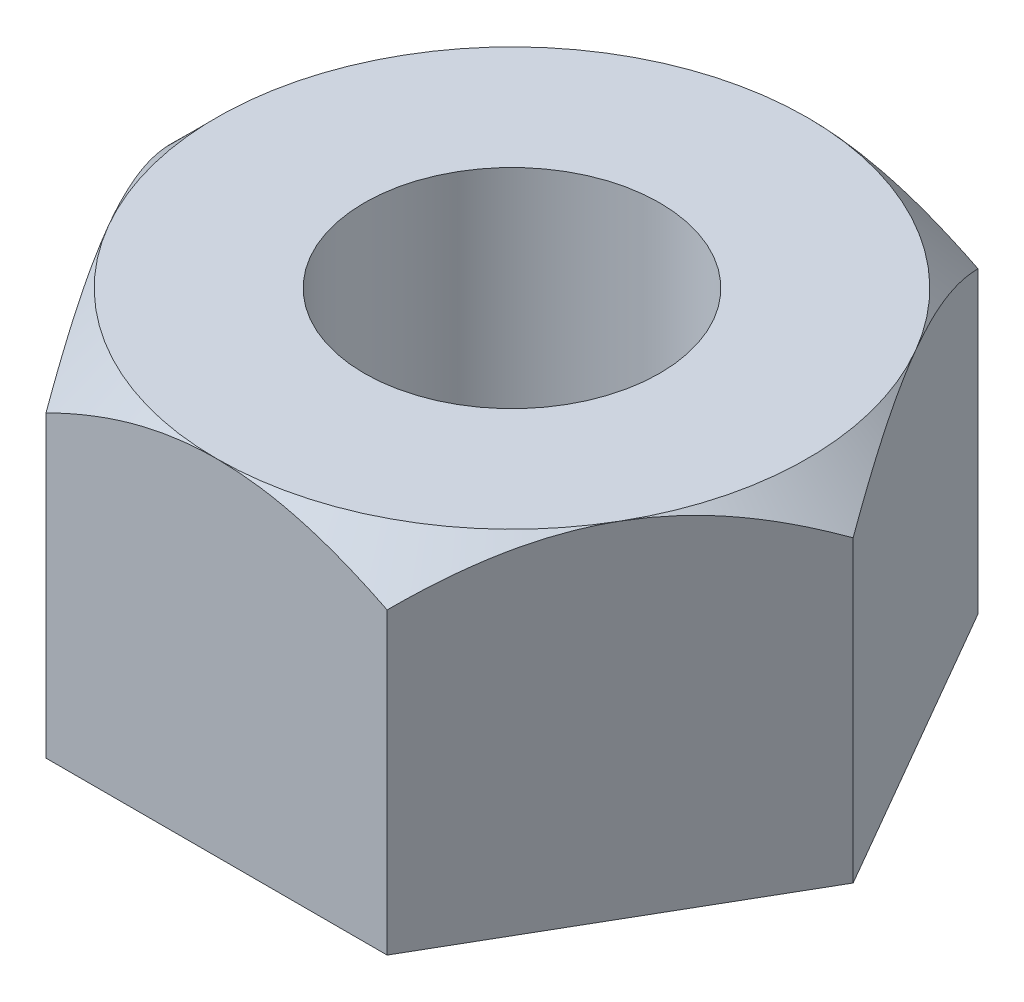
ISO-10303-21;
HEADER;
FILE_DESCRIPTION(('STEP AP214'),'2;1');
FILE_NAME('part.step','',(''),(''),'','','');
FILE_SCHEMA(('AUTOMOTIVE_DESIGN { 1 0 10303 214 1 1 1 1 }'));
ENDSEC;
DATA;
#1=APPLICATION_CONTEXT('core data for automotive mechanical design processes');
#2=APPLICATION_PROTOCOL_DEFINITION('international standard','automotive_design',2000,#1);
#3=PRODUCT_CONTEXT('',#1,'mechanical');
#4=PRODUCT('Part','Part','',(#3));
#5=PRODUCT_RELATED_PRODUCT_CATEGORY('part','',(#4));
#6=PRODUCT_DEFINITION_FORMATION('','',#4);
#7=PRODUCT_DEFINITION_CONTEXT('part definition',#1,'design');
#8=PRODUCT_DEFINITION('design','',#6,#7);
#9=PRODUCT_DEFINITION_SHAPE('','',#8);
#10=(LENGTH_UNIT() NAMED_UNIT(*) SI_UNIT(.MILLI.,.METRE.));
#11=(NAMED_UNIT(*) PLANE_ANGLE_UNIT() SI_UNIT($,.RADIAN.));
#12=(NAMED_UNIT(*) SI_UNIT($,.STERADIAN.) SOLID_ANGLE_UNIT());
#13=UNCERTAINTY_MEASURE_WITH_UNIT(LENGTH_MEASURE(1.E-05),#10,'distance_accuracy_value','');
#14=(GEOMETRIC_REPRESENTATION_CONTEXT(3) GLOBAL_UNCERTAINTY_ASSIGNED_CONTEXT((#13)) GLOBAL_UNIT_ASSIGNED_CONTEXT((#10,
#11,#12)) REPRESENTATION_CONTEXT('',''));
#15=CARTESIAN_POINT('',(0.,0.,0.));
#16=DIRECTION('',(0.,0.,1.));
#17=DIRECTION('',(1.,0.,0.));
#18=AXIS2_PLACEMENT_3D('',#15,#16,#17);
#19=CARTESIAN_POINT('',(0.,35.,0.));
#20=DIRECTION('',(0.,1.,0.));
#21=DIRECTION('',(0.,0.,1.));
#22=AXIS2_PLACEMENT_3D('',#19,#20,#21);
#23=PLANE('',#22);
#24=CARTESIAN_POINT('',(0.,35.,0.));
#25=DIRECTION('',(0.,1.,0.));
#26=DIRECTION('',(0.,0.,1.));
#27=AXIS2_PLACEMENT_3D('',#24,#25,#26);
#28=CIRCLE('',#27,15.);
#29=CARTESIAN_POINT('',(0.,35.,15.));
#30=VERTEX_POINT('',#29);
#31=EDGE_CURVE('E268',#30,#30,#28,.T.);
#32=ORIENTED_EDGE('',*,*,#31,.F.);
#33=EDGE_LOOP('',(#32));
#34=FACE_BOUND('',#33,.T.);
#35=CARTESIAN_POINT('',(0.,35.,0.));
#36=DIRECTION('',(0.,1.,0.));
#37=DIRECTION('',(0.,0.,1.));
#38=AXIS2_PLACEMENT_3D('',#35,#36,#37);
#39=CIRCLE('',#38,30.);
#40=CARTESIAN_POINT('',(-25.980762113533,35.,15.0000000000002));
#41=VERTEX_POINT('',#40);
#42=CARTESIAN_POINT('',(3.12250225675825E-13,35.,30.));
#43=VERTEX_POINT('',#42);
#44=EDGE_CURVE('E142',#41,#43,#39,.T.);
#45=ORIENTED_EDGE('',*,*,#44,.T.);
#46=CARTESIAN_POINT('',(25.9807621135333,35.,14.9999999999999));
#47=VERTEX_POINT('',#46);
#48=EDGE_CURVE('E126',#43,#47,#39,.T.);
#49=ORIENTED_EDGE('',*,*,#48,.T.);
#50=CARTESIAN_POINT('',(25.9807621135331,35.,-15.));
#51=VERTEX_POINT('',#50);
#52=EDGE_CURVE('E116',#47,#51,#39,.T.);
#53=ORIENTED_EDGE('',*,*,#52,.T.);
#54=CARTESIAN_POINT('',(0.,35.,-30.));
#55=VERTEX_POINT('',#54);
#56=EDGE_CURVE('E60',#51,#55,#39,.T.);
#57=ORIENTED_EDGE('',*,*,#56,.T.);
#58=CARTESIAN_POINT('',(-25.9807621135333,35.,-14.9999999999998));
#59=VERTEX_POINT('',#58);
#60=EDGE_CURVE('E68',#55,#59,#39,.T.);
#61=ORIENTED_EDGE('',*,*,#60,.T.);
#62=EDGE_CURVE('E146',#59,#41,#39,.T.);
#63=ORIENTED_EDGE('',*,*,#62,.T.);
#64=EDGE_LOOP('',(#45,#49,#53,#57,#61,#63));
#65=FACE_BOUND('',#64,.T.);
#66=ADVANCED_FACE('F38',(#34,#65),#23,.T.);
#67=CARTESIAN_POINT('',(17.3205080756891,35.,29.9999999999998));
#68=DIRECTION('',(-0.866025403784441,0.,-0.499999999999995));
#69=DIRECTION('',(-0.499999999999995,0.,0.866025403784441));
#70=AXIS2_PLACEMENT_3D('',#67,#68,#69);
#71=PLANE('',#70);
#72=CARTESIAN_POINT('',(17.3203926056353,30.3588683779913,30.0001999999998));
#73=CARTESIAN_POINT('',(17.6181648996009,30.6565922675911,29.484443257765));
#74=CARTESIAN_POINT('',(17.9182692240219,30.9452310098539,28.9646473202967));
#75=CARTESIAN_POINT('',(18.5235048397212,31.5014524216355,27.9163484833553));
#76=CARTESIAN_POINT('',(18.828638767824,31.7690235922971,27.3878410167682));
#77=CARTESIAN_POINT('',(19.4457355870908,32.28135715527,26.3189979726089));
#78=CARTESIAN_POINT('',(19.7577275741082,32.5259801897935,25.7786119995404));
#79=CARTESIAN_POINT('',(20.3868359587446,32.9871045468611,24.6889643138826));
#80=CARTESIAN_POINT('',(20.7039515645858,33.2036101686621,24.1397039726926));
#81=CARTESIAN_POINT('',(21.338183053422,33.6016347745125,23.0411828102682));
#82=CARTESIAN_POINT('',(21.6552206327595,33.7836500599617,22.4920576149471));
#83=CARTESIAN_POINT('',(22.2937926281989,34.1131992314035,21.3860184745553));
#84=CARTESIAN_POINT('',(22.615327264317,34.2607314240311,20.8291041484056));
#85=CARTESIAN_POINT('',(23.2614301523142,34.5175604489245,19.7100211194775));
#86=CARTESIAN_POINT('',(23.5859895047951,34.6269462759727,19.1478678309089));
#87=CARTESIAN_POINT('',(24.2378736643975,34.8050674934494,18.0187713458282));
#88=CARTESIAN_POINT('',(24.5651980509052,34.8738089576004,17.4518288778406));
#89=CARTESIAN_POINT('',(25.1280480592741,34.9552186228279,16.476944066305));
#90=CARTESIAN_POINT('',(25.3632091799513,34.9782734749676,16.0696330573272));
#91=CARTESIAN_POINT('',(25.8338106335002,35.0022474537773,15.2545274296647));
#92=CARTESIAN_POINT('',(26.0692509528371,35.0031676128692,14.8467328344231));
#93=CARTESIAN_POINT('',(26.5399741023156,34.9828501379884,14.0314164232274));
#94=CARTESIAN_POINT('',(26.7752568456213,34.9616045524011,13.6238947576778));
#95=CARTESIAN_POINT('',(27.2450758342509,34.8972716720897,12.8101443990106));
#96=CARTESIAN_POINT('',(27.4796120667069,34.8541840028935,12.403915728181));
#97=CARTESIAN_POINT('',(27.947702065918,34.7467531036108,11.5931600670326));
#98=CARTESIAN_POINT('',(28.1812545835327,34.6823881940278,11.1886352402883));
#99=CARTESIAN_POINT('',(28.6467513766859,34.5333163191623,10.3823711437865));
#100=CARTESIAN_POINT('',(28.878695465253,34.448607028423,9.98063219787308));
#101=CARTESIAN_POINT('',(29.3405639733419,34.2599824813795,9.18065247544698));
#102=CARTESIAN_POINT('',(29.5704888250559,34.1560714453666,8.78241095035556));
#103=CARTESIAN_POINT('',(30.0281274167467,33.9302733745607,7.98975765804288));
#104=CARTESIAN_POINT('',(30.2558409765441,33.8083848878218,7.59534620290149));
#105=CARTESIAN_POINT('',(30.8420828137656,33.4713620227356,6.5799455553113));
#106=CARTESIAN_POINT('',(31.1987982858363,33.2435417347324,5.96209623383893));
#107=CARTESIAN_POINT('',(31.905785122213,32.7512157331125,4.73755911295196));
#108=CARTESIAN_POINT('',(32.2560562916387,32.4867089121269,4.13087165108014));
#109=CARTESIAN_POINT('',(32.9491182127463,31.9268817702841,2.93045319093047));
#110=CARTESIAN_POINT('',(33.2919285978236,31.6316583559979,2.33668818661439));
#111=CARTESIAN_POINT('',(33.8014058168872,31.1686767682003,1.45424775789719));
#112=CARTESIAN_POINT('',(33.9703976679074,31.0110362757961,1.16154528586509));
#113=CARTESIAN_POINT('',(34.3068764117072,30.6895144365808,0.578747005936949));
#114=CARTESIAN_POINT('',(34.4743634123152,30.5256335413985,0.288651011276554));
#115=CARTESIAN_POINT('',(34.6411316214314,30.3588683779913,-0.000199999999995456));
#116=B_SPLINE_CURVE_WITH_KNOTS('',3,(#72,#73,#74,#75,#76,#77,#78,#79,#80,#81,#82,#83,#84,#85,
#86,#87,#88,#89,#90,#91,#92,#93,#94,#95,#96,#97,#98,#99,#100,#101,#102,#103,#104,#105,#106,#107,
#108,#109,#110,#111,#112,#113,#114,#115),.UNSPECIFIED.,.F.,.F.,(4,2,2,2,2,2,2,2,2,2,2,2,2,2,2,2,
2,2,2,2,2,4),(0.,1.99753698906529,3.99615679966399,6.00621930499647,8.01597410154384,
9.99414881902824,11.9724206585555,13.9460458550607,15.919376046739,17.3315544125027,
18.7436669103266,20.1562861556898,21.5689296205616,22.9830168949964,24.3972658831385,
25.8112044068452,27.2252571896591,29.470786039701,31.7163826849258,33.9550980748502,
35.0738628932081,36.1925468979111),.UNSPECIFIED.);
#117=CARTESIAN_POINT('',(17.3205080756891,30.3589838486225,29.9999999999998));
#118=VERTEX_POINT('',#117);
#119=EDGE_CURVE('E131',#118,#47,#116,.T.);
#120=ORIENTED_EDGE('',*,*,#119,.F.);
#121=DIRECTION('',(0.,-1.,0.));
#122=VECTOR('',#121,1.);
#123=CARTESIAN_POINT('',(17.3205080756891,35.,29.9999999999998));
#124=LINE('',#123,#122);
#125=CARTESIAN_POINT('',(17.3205080756891,0.,29.9999999999998));
#126=VERTEX_POINT('',#125);
#127=EDGE_CURVE('E244',#118,#126,#124,.T.);
#128=ORIENTED_EDGE('',*,*,#127,.T.);
#129=DIRECTION('',(0.499999999999995,0.,-0.866025403784441));
#130=VECTOR('',#129,1.);
#131=CARTESIAN_POINT('',(17.3205080756891,0.,29.9999999999998));
#132=LINE('',#131,#130);
#133=CARTESIAN_POINT('',(34.6410161513776,0.,0.));
#134=VERTEX_POINT('',#133);
#135=EDGE_CURVE('E266',#126,#134,#132,.T.);
#136=ORIENTED_EDGE('',*,*,#135,.T.);
#137=DIRECTION('',(0.,-1.,0.));
#138=VECTOR('',#137,1.);
#139=CARTESIAN_POINT('',(34.6410161513776,35.,0.));
#140=LINE('',#139,#138);
#141=CARTESIAN_POINT('',(34.6410161513776,30.3589838486225,0.));
#142=VERTEX_POINT('',#141);
#143=EDGE_CURVE('E139',#142,#134,#140,.T.);
#144=ORIENTED_EDGE('',*,*,#143,.F.);
#145=EDGE_CURVE('E120',#47,#142,#116,.T.);
#146=ORIENTED_EDGE('',*,*,#145,.F.);
#147=EDGE_LOOP('',(#120,#128,#136,#144,#146));
#148=FACE_BOUND('',#147,.T.);
#149=ADVANCED_FACE('F40',(#148),#71,.F.);
#150=CARTESIAN_POINT('',(34.6410161513776,35.,0.));
#151=DIRECTION('',(-0.866025403784438,0.,0.500000000000001));
#152=DIRECTION('',(0.500000000000001,0.,0.866025403784438));
#153=AXIS2_PLACEMENT_3D('',#150,#151,#152);
#154=PLANE('',#153);
#155=CARTESIAN_POINT('',(34.6411316214314,30.3588683779913,0.0002));
#156=CARTESIAN_POINT('',(34.3433593274658,30.6565922675911,-0.51555674223478));
#157=CARTESIAN_POINT('',(34.0432550030448,30.9452310098539,-1.03535267970308));
#158=CARTESIAN_POINT('',(33.4380193873455,31.5014524216355,-2.08365151664448));
#159=CARTESIAN_POINT('',(33.1328854592427,31.7690235922971,-2.61215898323161));
#160=CARTESIAN_POINT('',(32.5157886399759,32.2813571552701,-3.68100202739093));
#161=CARTESIAN_POINT('',(32.2037966529584,32.5259801897936,-4.22138800045949));
#162=CARTESIAN_POINT('',(31.574688268322,32.9871045468612,-5.31103568611726));
#163=CARTESIAN_POINT('',(31.2575726624808,33.2036101686621,-5.86029602730727));
#164=CARTESIAN_POINT('',(30.6233411736446,33.6016347745126,-6.95881718973164));
#165=CARTESIAN_POINT('',(30.3063035943071,33.7836500599618,-7.50794238505278));
#166=CARTESIAN_POINT('',(29.6677315988676,34.1131992314036,-8.61398152544462));
#167=CARTESIAN_POINT('',(29.3461969627495,34.2607314240312,-9.17089585159433));
#168=CARTESIAN_POINT('',(28.7000940747524,34.5175604489246,-10.2899788805224));
#169=CARTESIAN_POINT('',(28.3755347222715,34.6269462759728,-10.852132169091));
#170=CARTESIAN_POINT('',(27.7236505626691,34.8050674934496,-11.9812286541717));
#171=CARTESIAN_POINT('',(27.3963261761614,34.8738089576005,-12.5481711221593));
#172=CARTESIAN_POINT('',(26.8334761677924,34.955218622828,-13.5230559336949));
#173=CARTESIAN_POINT('',(26.5983150471152,34.9782734749677,-13.9303669426727));
#174=CARTESIAN_POINT('',(26.1277135935663,35.0022474537774,-14.7454725703352));
#175=CARTESIAN_POINT('',(25.8922732742294,35.0031676128693,-15.1532671655768));
#176=CARTESIAN_POINT('',(25.4215501247509,34.9828501379885,-15.9685835767725));
#177=CARTESIAN_POINT('',(25.1862673814452,34.9616045524012,-16.3761052423221));
#178=CARTESIAN_POINT('',(24.7164483928156,34.8972716720899,-17.1898556009893));
#179=CARTESIAN_POINT('',(24.4819121603596,34.8541840028936,-17.5960842718189));
#180=CARTESIAN_POINT('',(24.0138221611485,34.7467531036109,-18.4068399329673));
#181=CARTESIAN_POINT('',(23.7802696435338,34.682388194028,-18.8113647597116));
#182=CARTESIAN_POINT('',(23.3147728503806,34.5333163191625,-19.6176288562134));
#183=CARTESIAN_POINT('',(23.0828287618135,34.4486070284231,-20.0193678021268));
#184=CARTESIAN_POINT('',(22.6209602537246,34.2599824813796,-20.8193475245529));
#185=CARTESIAN_POINT('',(22.3910354020105,34.1560714453667,-21.2175890496443));
#186=CARTESIAN_POINT('',(21.9333968103198,33.9302733745608,-22.010242341957));
#187=CARTESIAN_POINT('',(21.7056832505224,33.808384887822,-22.4046537970984));
#188=CARTESIAN_POINT('',(21.1194414133009,33.4713620227358,-23.4200544446886));
#189=CARTESIAN_POINT('',(20.7627259412302,33.2435417347325,-24.037903766161));
#190=CARTESIAN_POINT('',(20.0557391048534,32.7512157331126,-25.262440887048));
#191=CARTESIAN_POINT('',(19.7054679354277,32.486708912127,-25.8691283489198));
#192=CARTESIAN_POINT('',(19.0124060143201,31.9268817702841,-27.0695468090695));
#193=CARTESIAN_POINT('',(18.6695956292428,31.6316583559979,-27.6633118133856));
#194=CARTESIAN_POINT('',(18.1601184101791,31.1686767682003,-28.5457522421028));
#195=CARTESIAN_POINT('',(17.9911265591589,31.0110362757962,-28.8384547141349));
#196=CARTESIAN_POINT('',(17.6546478153591,30.6895144365808,-29.4212529940631));
#197=CARTESIAN_POINT('',(17.4871608147511,30.5256335413985,-29.7113489887235));
#198=CARTESIAN_POINT('',(17.3203926056349,30.3588683779913,-30.0002000000001));
#199=B_SPLINE_CURVE_WITH_KNOTS('',3,(#155,#156,#157,#158,#159,#160,#161,#162,#163,#164,#165,
#166,#167,#168,#169,#170,#171,#172,#173,#174,#175,#176,#177,#178,#179,#180,#181,#182,#183,#184,
#185,#186,#187,#188,#189,#190,#191,#192,#193,#194,#195,#196,#197,#198),.UNSPECIFIED.,.F.,.F.,(4,
2,2,2,2,2,2,2,2,2,2,2,2,2,2,2,2,2,2,2,2,4),(0.,1.99753698906531,3.99615679966405,
6.00621930499656,8.01597410154395,9.99414881902838,11.9724206585557,13.9460458550609,
15.9193760467392,17.3315544125029,18.7436669103268,20.15628615569,21.5689296205617,
22.9830168949966,24.3972658831386,25.8112044068453,27.2252571896593,29.4707860397013,
31.7163826849261,33.9550980748506,35.0738628932085,36.1925468979116),.UNSPECIFIED.);
#200=EDGE_CURVE('E122',#142,#51,#199,.T.);
#201=ORIENTED_EDGE('',*,*,#200,.F.);
#202=ORIENTED_EDGE('',*,*,#143,.T.);
#203=DIRECTION('',(-0.500000000000001,0.,-0.866025403784438));
#204=VECTOR('',#203,1.);
#205=CARTESIAN_POINT('',(34.6410161513776,0.,0.));
#206=LINE('',#205,#204);
#207=CARTESIAN_POINT('',(17.3205080756887,0.,-30.0000000000001));
#208=VERTEX_POINT('',#207);
#209=EDGE_CURVE('E264',#134,#208,#206,.T.);
#210=ORIENTED_EDGE('',*,*,#209,.T.);
#211=DIRECTION('',(0.,-1.,0.));
#212=VECTOR('',#211,1.);
#213=CARTESIAN_POINT('',(17.3205080756887,35.,-30.0000000000001));
#214=LINE('',#213,#212);
#215=CARTESIAN_POINT('',(17.3205080756887,30.3589838486225,-30.0000000000001));
#216=VERTEX_POINT('',#215);
#217=EDGE_CURVE('E245',#216,#208,#214,.T.);
#218=ORIENTED_EDGE('',*,*,#217,.F.);
#219=EDGE_CURVE('E195',#51,#216,#199,.T.);
#220=ORIENTED_EDGE('',*,*,#219,.F.);
#221=EDGE_LOOP('',(#201,#202,#210,#218,#220));
#222=FACE_BOUND('',#221,.T.);
#223=ADVANCED_FACE('F206',(#222),#154,.F.);
#224=CARTESIAN_POINT('',(17.3205080756887,35.,-30.0000000000001));
#225=DIRECTION('',(0.,0.,1.));
#226=DIRECTION('',(1.,0.,0.));
#227=AXIS2_PLACEMENT_3D('',#224,#225,#226);
#228=PLANE('',#227);
#229=CARTESIAN_POINT('',(53.3762208303287,3.7707508609814,-30.0000000000002));
#230=CARTESIAN_POINT('',(52.5899112935375,4.45618424065395,-30.0000000000002));
#231=CARTESIAN_POINT('',(51.8018231001401,5.13958451542431,-30.0000000000002));
#232=CARTESIAN_POINT('',(50.221606945329,6.50172219083448,-30.0000000000002));
#233=CARTESIAN_POINT('',(49.4294789213486,7.18045951887281,-30.0000000000002));
#234=CARTESIAN_POINT('',(47.8403629772424,8.53296146538885,-30.0000000000002));
#235=CARTESIAN_POINT('',(47.0433730065573,9.20672367631412,-30.0000000000002));
#236=CARTESIAN_POINT('',(45.4443281849743,10.5482089887155,-30.0000000000001));
#237=CARTESIAN_POINT('',(44.6422733509163,11.2159321102526,-30.0000000000001));
#238=CARTESIAN_POINT('',(43.0151354428465,12.5587356033502,-30.0000000000001));
#239=CARTESIAN_POINT('',(42.1899280394089,13.233665448815,-30.0000000000001));
#240=CARTESIAN_POINT('',(40.5327333081042,14.5751475514541,-30.0000000000001));
#241=CARTESIAN_POINT('',(39.7007460208972,15.2416998588089,-30.0000000000001));
#242=CARTESIAN_POINT('',(38.0292227386056,16.5648785521387,-30.0000000000001));
#243=CARTESIAN_POINT('',(37.1896885538882,17.22150722236,-30.0000000000001));
#244=CARTESIAN_POINT('',(35.5017506205298,18.5232789735943,-30.0000000000001));
#245=CARTESIAN_POINT('',(34.653346880093,19.16842206523,-30.0000000000001));
#246=CARTESIAN_POINT('',(32.9453175754436,20.4458520954125,-30.0000000000001));
#247=CARTESIAN_POINT('',(32.0856798273586,21.0781227725366,-30.0000000000001));
#248=CARTESIAN_POINT('',(30.354591070083,22.3263379096767,-30.0000000000001));
#249=CARTESIAN_POINT('',(29.4831399309618,22.9422821899049,-30.0000000000001));
#250=CARTESIAN_POINT('',(27.7258401564876,24.1549590975813,-30.0000000000001));
#251=CARTESIAN_POINT('',(26.8399799193667,24.7516749602692,-30.0000000000001));
#252=CARTESIAN_POINT('',(25.0524568915284,25.9209968471937,-30.0000000000001));
#253=CARTESIAN_POINT('',(24.1507944443686,26.493603394675,-30.0000000000001));
#254=CARTESIAN_POINT('',(22.3354224518824,27.6053535358818,-30.0000000000001));
#255=CARTESIAN_POINT('',(21.4218367160625,28.1446984076666,-30.0000000000001));
#256=CARTESIAN_POINT('',(19.5739603363612,29.1871835769758,-30.0000000000001));
#257=CARTESIAN_POINT('',(18.6396672082826,29.6903194995456,-30.0000000000001));
#258=CARTESIAN_POINT('',(16.7493147451587,30.6506535003385,-30.));
#259=CARTESIAN_POINT('',(15.7932886833023,31.1079166721131,-30.));
#260=CARTESIAN_POINT('',(13.8562977747821,31.9660198201572,-30.));
#261=CARTESIAN_POINT('',(12.8753426324504,32.3668813668236,-30.));
#262=CARTESIAN_POINT('',(11.3734012031044,32.9199251364642,-30.));
#263=CARTESIAN_POINT('',(10.8618614597269,33.0979132844138,-30.));
#264=CARTESIAN_POINT('',(9.83216267605124,33.4336486149706,-30.));
#265=CARTESIAN_POINT('',(9.31400389520752,33.5913965882954,-30.));
#266=CARTESIAN_POINT('',(8.27142343038701,33.8846299767694,-30.));
#267=CARTESIAN_POINT('',(7.74700198055922,34.0201162214634,-30.));
#268=CARTESIAN_POINT('',(6.69249353454881,34.2668460091694,-30.));
#269=CARTESIAN_POINT('',(6.1624068979404,34.3780910813151,-30.));
#270=CARTESIAN_POINT('',(5.10098712899061,34.5738620044296,-30.));
#271=CARTESIAN_POINT('',(4.56968638039515,34.6585625940133,-30.));
#272=CARTESIAN_POINT('',(3.50344115246566,34.8007454033289,-30.));
#273=CARTESIAN_POINT('',(2.96849671283566,34.8582279191667,-30.));
#274=CARTESIAN_POINT('',(1.89635822462354,34.9448717162712,-30.));
#275=CARTESIAN_POINT('',(1.35916439818411,34.9740357308908,-30.));
#276=CARTESIAN_POINT('',(0.283981051434167,35.0034690946449,-30.));
#277=CARTESIAN_POINT('',(-0.254008469184844,35.0037384325739,-30.));
#278=CARTESIAN_POINT('',(-1.3306263739986,34.9753396686805,-30.));
#279=CARTESIAN_POINT('',(-1.86925275304704,34.9465959351262,-30.));
#280=CARTESIAN_POINT('',(-2.94421752020681,34.8606345981751,-30.));
#281=CARTESIAN_POINT('',(-3.48055589908207,34.8034168799459,-30.));
#282=CARTESIAN_POINT('',(-4.54966295546421,34.661598071898,-30.));
#283=CARTESIAN_POINT('',(-5.08243107949571,34.5769928322058,-30.));
#284=CARTESIAN_POINT('',(-6.14319174808165,34.381917663545,-30.));
#285=CARTESIAN_POINT('',(-6.67118424355944,34.2714474690887,-30.));
#286=CARTESIAN_POINT('',(-7.72544706417886,34.0255300937026,-30.));
#287=CARTESIAN_POINT('',(-8.25167518759626,33.889902803497,-30.));
#288=CARTESIAN_POINT('',(-9.2978414373201,33.5962144682504,-30.));
#289=CARTESIAN_POINT('',(-9.81777916407174,33.4381520062019,-30.));
#290=CARTESIAN_POINT('',(-10.8509496131266,33.1016529951304,-30.));
#291=CARTESIAN_POINT('',(-11.3641828553264,32.9232180364618,-30.));
#292=CARTESIAN_POINT('',(-12.3838674089085,32.54795203962,-30.));
#293=CARTESIAN_POINT('',(-12.8903185446281,32.351120526009,-30.));
#294=CARTESIAN_POINT('',(-13.9932847397594,31.9014818579638,-30.));
#295=CARTESIAN_POINT('',(-14.5883783671297,31.6451916375016,-30.));
#296=CARTESIAN_POINT('',(-15.7693153624404,31.1120424425095,-29.9999999999999));
#297=CARTESIAN_POINT('',(-16.3551577044245,30.8351812058348,-29.9999999999999));
#298=CARTESIAN_POINT('',(-17.5182668400715,30.2633754851468,-29.9999999999999));
#299=CARTESIAN_POINT('',(-18.0955294676918,29.9684225512102,-29.9999999999999));
#300=CARTESIAN_POINT('',(-19.2417258585187,29.3628387074378,-29.9999999999999));
#301=CARTESIAN_POINT('',(-19.8106598798256,29.0522082847739,-29.9999999999999));
#302=CARTESIAN_POINT('',(-20.9419376743481,28.4165970017628,-29.9999999999999));
#303=CARTESIAN_POINT('',(-21.5042659568889,28.0915886321577,-29.9999999999999));
#304=CARTESIAN_POINT('',(-22.6217673036964,27.429509581404,-29.9999999999999));
#305=CARTESIAN_POINT('',(-23.1769403181454,27.0924388163343,-29.9999999999999));
#306=CARTESIAN_POINT('',(-24.280576467166,26.4077840644198,-29.9999999999999));
#307=CARTESIAN_POINT('',(-24.8290411262225,26.0602025309396,-29.9999999999999));
#308=CARTESIAN_POINT('',(-25.9199507289388,25.3557012770479,-29.9999999999999));
#309=CARTESIAN_POINT('',(-26.4623955193949,24.9987813197491,-29.9999999999999));
#310=CARTESIAN_POINT('',(-27.5447023825758,24.2747260105825,-29.9999999999999));
#311=CARTESIAN_POINT('',(-28.0845342721113,23.9075455896459,-29.9999999999999));
#312=CARTESIAN_POINT('',(-29.1590930659217,23.165782761121,-29.9999999999999));
#313=CARTESIAN_POINT('',(-29.6938198877022,22.7912002342189,-29.9999999999999));
#314=CARTESIAN_POINT('',(-31.2910171889627,21.6575947225762,-29.9999999999999));
#315=CARTESIAN_POINT('',(-32.3465011470261,20.88871606734,-29.9999999999999));
#316=CARTESIAN_POINT('',(-34.4406160663747,19.3308906181443,-29.9999999999999));
#317=CARTESIAN_POINT('',(-35.4792648724767,18.5419677073022,-29.9999999999999));
#318=CARTESIAN_POINT('',(-37.5433963500479,16.9471384655356,-29.9999999999999));
#319=CARTESIAN_POINT('',(-38.5688791938664,16.1412323572957,-29.9999999999999));
#320=CARTESIAN_POINT('',(-40.7684552024115,14.3881525728219,-29.9999999999999));
#321=CARTESIAN_POINT('',(-41.9406678953483,13.4386228890471,-29.9999999999999));
#322=CARTESIAN_POINT('',(-44.2727081672995,11.524496863542,-29.9999999999999));
#323=CARTESIAN_POINT('',(-45.4325357049982,10.5599004715772,-29.9999999999998));
#324=CARTESIAN_POINT('',(-47.727948920672,8.63001046804013,-29.9999999999998));
#325=CARTESIAN_POINT('',(-48.8636584945499,7.66486406687404,-29.9999999999998));
#326=CARTESIAN_POINT('',(-50.5606358893224,6.20975055089955,-29.9999999999998));
#327=CARTESIAN_POINT('',(-51.1251304498412,5.72353865747696,-29.9999999999998));
#328=CARTESIAN_POINT('',(-52.2521281872887,4.74881766405668,-29.9999999999998));
#329=CARTESIAN_POINT('',(-52.814631373911,4.26030857526831,-29.9999999999998));
#330=CARTESIAN_POINT('',(-53.3762208303289,3.77075086098139,-29.9999999999998));
#331=B_SPLINE_CURVE_WITH_KNOTS('',3,(#229,#230,#231,#232,#233,#234,#235,#236,#237,#238,#239,
#240,#241,#242,#243,#244,#245,#246,#247,#248,#249,#250,#251,#252,#253,#254,#255,#256,#257,#258,
#259,#260,#261,#262,#263,#264,#265,#266,#267,#268,#269,#270,#271,#272,#273,#274,#275,#276,#277,
#278,#279,#280,#281,#282,#283,#284,#285,#286,#287,#288,#289,#290,#291,#292,#293,#294,#295,#296,
#297,#298,#299,#300,#301,#302,#303,#304,#305,#306,#307,#308,#309,#310,#311,#312,#313,#314,#315,
#316,#317,#318,#319,#320,#321,#322,#323,#324,#325,#326,#327,#328,#329,#330),.UNSPECIFIED.,.F.,
.F.,(4,2,2,2,2,2,2,2,2,2,2,2,2,2,2,2,2,2,2,2,2,2,2,2,2,2,2,2,2,2,2,2,2,2,2,2,2,2,2,2,2,2,2,2,2,
2,2,2,2,2,4),(0.,3.12936690581869,6.25878242555446,9.38962432239308,12.5204558152323,
15.7186078021915,18.9167406234128,22.1141257207996,25.3115078608851,28.5127057733556,
31.7139389230846,34.9178915148417,38.1217745353062,41.3038452788751,44.4862998536259,
47.6641726696341,50.8408268081317,52.4653426052845,54.0897949185537,55.7141866856848,
57.3384759564748,58.9518365381315,60.5651795676012,62.1783668588025,63.7915547756089,
65.4089588645834,67.0263694764243,68.6440252800002,70.2616976885335,71.8914329961113,
73.5212712837579,75.150982426915,76.7807356997369,78.724085285751,80.6676488944107,
82.6121272817308,84.5565452823118,86.5048596707014,88.4531876166399,90.4010642526863,
92.3489903483743,94.3075315890573,96.2661044250515,100.183262235539,104.095953372375,
108.008593237695,112.534051298393,117.059524450902,121.530702953966,123.765760641309,
126.000807433823),.UNSPECIFIED.);
#332=EDGE_CURVE('E200',#216,#55,#331,.T.);
#333=ORIENTED_EDGE('',*,*,#332,.F.);
#334=ORIENTED_EDGE('',*,*,#217,.T.);
#335=DIRECTION('',(-1.,0.,0.));
#336=VECTOR('',#335,1.);
#337=CARTESIAN_POINT('',(17.3205080756887,0.,-30.0000000000001));
#338=LINE('',#337,#336);
#339=CARTESIAN_POINT('',(-17.3205080756889,0.,-29.9999999999999));
#340=VERTEX_POINT('',#339);
#341=EDGE_CURVE('E261',#208,#340,#338,.T.);
#342=ORIENTED_EDGE('',*,*,#341,.T.);
#343=DIRECTION('',(0.,-1.,0.));
#344=VECTOR('',#343,1.);
#345=CARTESIAN_POINT('',(-17.3205080756889,35.,-29.9999999999999));
#346=LINE('',#345,#344);
#347=CARTESIAN_POINT('',(-17.3205080756889,30.3589838486225,-29.9999999999999));
#348=VERTEX_POINT('',#347);
#349=EDGE_CURVE('E248',#348,#340,#346,.T.);
#350=ORIENTED_EDGE('',*,*,#349,.F.);
#351=EDGE_CURVE('E158',#55,#348,#331,.T.);
#352=ORIENTED_EDGE('',*,*,#351,.F.);
#353=EDGE_LOOP('',(#333,#334,#342,#350,#352));
#354=FACE_BOUND('',#353,.T.);
#355=ADVANCED_FACE('F209',(#354),#228,.F.);
#356=CARTESIAN_POINT('',(-17.3205080756889,35.,-29.9999999999999));
#357=DIRECTION('',(0.866025403784442,0.,0.499999999999995));
#358=DIRECTION('',(0.499999999999995,0.,-0.866025403784442));
#359=AXIS2_PLACEMENT_3D('',#356,#357,#358);
#360=PLANE('',#359);
#361=CARTESIAN_POINT('',(-17.3203926056351,30.3588683779913,-30.0001999999999));
#362=CARTESIAN_POINT('',(-17.6181648996007,30.6565922675911,-29.4844432577652));
#363=CARTESIAN_POINT('',(-17.9182692240217,30.9452310098539,-28.9646473202969));
#364=CARTESIAN_POINT('',(-18.523504839721,31.5014524216355,-27.9163484833555));
#365=CARTESIAN_POINT('',(-18.8286387678238,31.7690235922971,-27.3878410167683));
#366=CARTESIAN_POINT('',(-19.4457355870906,32.2813571552701,-26.318997972609));
#367=CARTESIAN_POINT('',(-19.757727574108,32.5259801897936,-25.7786119995404));
#368=CARTESIAN_POINT('',(-20.3868359587444,32.9871045468612,-24.6889643138827));
#369=CARTESIAN_POINT('',(-20.7039515645856,33.2036101686621,-24.1397039726926));
#370=CARTESIAN_POINT('',(-21.3381830534218,33.6016347745126,-23.0411828102683));
#371=CARTESIAN_POINT('',(-21.6552206327593,33.7836500599618,-22.4920576149471));
#372=CARTESIAN_POINT('',(-22.2937926281988,34.1131992314036,-21.3860184745553));
#373=CARTESIAN_POINT('',(-22.6153272643169,34.2607314240312,-20.8291041484056));
#374=CARTESIAN_POINT('',(-23.261430152314,34.5175604489246,-19.7100211194775));
#375=CARTESIAN_POINT('',(-23.5859895047949,34.6269462759728,-19.1478678309089));
#376=CARTESIAN_POINT('',(-24.2378736643973,34.8050674934496,-18.0187713458282));
#377=CARTESIAN_POINT('',(-24.565198050905,34.8738089576005,-17.4518288778406));
#378=CARTESIAN_POINT('',(-25.128048059274,34.955218622828,-16.476944066305));
#379=CARTESIAN_POINT('',(-25.3632091799512,34.9782734749677,-16.0696330573272));
#380=CARTESIAN_POINT('',(-25.8338106335001,35.0022474537774,-15.2545274296647));
#381=CARTESIAN_POINT('',(-26.069250952837,35.0031676128693,-14.846732834423));
#382=CARTESIAN_POINT('',(-26.5399741023155,34.9828501379885,-14.0314164232274));
#383=CARTESIAN_POINT('',(-26.7752568456212,34.9616045524012,-13.6238947576777));
#384=CARTESIAN_POINT('',(-27.2450758342508,34.8972716720899,-12.8101443990106));
#385=CARTESIAN_POINT('',(-27.4796120667068,34.8541840028936,-12.403915728181));
#386=CARTESIAN_POINT('',(-27.9477020659178,34.7467531036109,-11.5931600670326));
#387=CARTESIAN_POINT('',(-28.1812545835326,34.682388194028,-11.1886352402882));
#388=CARTESIAN_POINT('',(-28.6467513766858,34.5333163191625,-10.3823711437864));
#389=CARTESIAN_POINT('',(-28.8786954652528,34.4486070284231,-9.98063219787306));
#390=CARTESIAN_POINT('',(-29.3405639733418,34.2599824813796,-9.18065247544696));
#391=CARTESIAN_POINT('',(-29.5704888250558,34.1560714453667,-8.78241095035554));
#392=CARTESIAN_POINT('',(-30.0281274167466,33.9302733745608,-7.98975765804286));
#393=CARTESIAN_POINT('',(-30.2558409765439,33.808384887822,-7.59534620290147));
#394=CARTESIAN_POINT('',(-30.8420828137654,33.4713620227358,-6.57994555531126));
#395=CARTESIAN_POINT('',(-31.1987982858361,33.2435417347325,-5.96209623383887));
#396=CARTESIAN_POINT('',(-31.9057851222129,32.7512157331126,-4.73755911295186));
#397=CARTESIAN_POINT('',(-32.2560562916386,32.486708912127,-4.13087165108002));
#398=CARTESIAN_POINT('',(-32.9491182127462,31.9268817702842,-2.93045319093032));
#399=CARTESIAN_POINT('',(-33.2919285978235,31.631658355998,-2.33668818661421));
#400=CARTESIAN_POINT('',(-33.8014058168872,31.1686767682003,-1.45424775789699));
#401=CARTESIAN_POINT('',(-33.9703976679074,31.0110362757962,-1.16154528586488));
#402=CARTESIAN_POINT('',(-34.3068764117072,30.6895144365808,-0.578747005936724));
#403=CARTESIAN_POINT('',(-34.4743634123152,30.5256335413985,-0.28865101127632));
#404=CARTESIAN_POINT('',(-34.6411316214314,30.3588683779913,0.000200000000238129));
#405=B_SPLINE_CURVE_WITH_KNOTS('',3,(#361,#362,#363,#364,#365,#366,#367,#368,#369,#370,#371,
#372,#373,#374,#375,#376,#377,#378,#379,#380,#381,#382,#383,#384,#385,#386,#387,#388,#389,#390,
#391,#392,#393,#394,#395,#396,#397,#398,#399,#400,#401,#402,#403,#404),.UNSPECIFIED.,.F.,.F.,(4,
2,2,2,2,2,2,2,2,2,2,2,2,2,2,2,2,2,2,2,2,4),(0.,1.99753698906531,3.99615679966405,
6.00621930499656,8.01597410154395,9.99414881902839,11.9724206585557,13.9460458550609,
15.9193760467392,17.3315544125029,18.7436669103269,20.15628615569,21.5689296205618,
22.9830168949966,24.3972658831387,25.8112044068454,27.2252571896593,29.4707860397013,
31.7163826849261,33.9550980748506,35.0738628932085,36.1925468979116),.UNSPECIFIED.);
#406=EDGE_CURVE('E155',#348,#59,#405,.T.);
#407=ORIENTED_EDGE('',*,*,#406,.F.);
#408=ORIENTED_EDGE('',*,*,#349,.T.);
#409=DIRECTION('',(-0.499999999999995,0.,0.866025403784442));
#410=VECTOR('',#409,1.);
#411=CARTESIAN_POINT('',(-17.3205080756889,0.,-29.9999999999999));
#412=LINE('',#411,#410);
#413=CARTESIAN_POINT('',(-34.6410161513776,0.,2.41896922902197E-13));
#414=VERTEX_POINT('',#413);
#415=EDGE_CURVE('E259',#340,#414,#412,.T.);
#416=ORIENTED_EDGE('',*,*,#415,.T.);
#417=DIRECTION('',(0.,-1.,0.));
#418=VECTOR('',#417,1.);
#419=CARTESIAN_POINT('',(-34.6410161513776,35.,2.41896922902197E-13));
#420=LINE('',#419,#418);
#421=CARTESIAN_POINT('',(-34.6410161513776,30.3589838486225,2.41162068837631E-13));
#422=VERTEX_POINT('',#421);
#423=EDGE_CURVE('E165',#422,#414,#420,.T.);
#424=ORIENTED_EDGE('',*,*,#423,.F.);
#425=EDGE_CURVE('E151',#59,#422,#405,.T.);
#426=ORIENTED_EDGE('',*,*,#425,.F.);
#427=EDGE_LOOP('',(#407,#408,#416,#424,#426));
#428=FACE_BOUND('',#427,.T.);
#429=ADVANCED_FACE('F163',(#428),#360,.F.);
#430=CARTESIAN_POINT('',(-34.6410161513776,35.,2.41896922902197E-13));
#431=DIRECTION('',(0.866025403784435,0.,-0.500000000000007));
#432=DIRECTION('',(-0.500000000000007,0.,-0.866025403784434));
#433=AXIS2_PLACEMENT_3D('',#430,#431,#432);
#434=PLANE('',#433);
#435=CARTESIAN_POINT('',(-34.6411316214314,30.3588683779913,-0.000199999999758103));
#436=CARTESIAN_POINT('',(-34.3433593274658,30.6565922675911,0.515556742235021));
#437=CARTESIAN_POINT('',(-34.0432550030448,30.9452310098539,1.03535267970331));
#438=CARTESIAN_POINT('',(-33.4380193873455,31.5014524216355,2.08365151664471));
#439=CARTESIAN_POINT('',(-33.1328854592427,31.7690235922971,2.61215898323184));
#440=CARTESIAN_POINT('',(-32.5157886399758,32.2813571552701,3.68100202739115));
#441=CARTESIAN_POINT('',(-32.2037966529584,32.5259801897936,4.22138800045971));
#442=CARTESIAN_POINT('',(-31.574688268322,32.9871045468612,5.31103568611747));
#443=CARTESIAN_POINT('',(-31.2575726624808,33.2036101686621,5.86029602730747));
#444=CARTESIAN_POINT('',(-30.6233411736445,33.6016347745126,6.95881718973184));
#445=CARTESIAN_POINT('',(-30.3063035943071,33.7836500599618,7.50794238505298));
#446=CARTESIAN_POINT('',(-29.6677315988676,34.1131992314036,8.61398152544481));
#447=CARTESIAN_POINT('',(-29.3461969627495,34.2607314240312,9.17089585159452));
#448=CARTESIAN_POINT('',(-28.7000940747523,34.5175604489246,10.2899788805226));
#449=CARTESIAN_POINT('',(-28.3755347222714,34.6269462759728,10.8521321690912));
#450=CARTESIAN_POINT('',(-27.723650562669,34.8050674934496,11.9812286541719));
#451=CARTESIAN_POINT('',(-27.3963261761613,34.8738089576005,12.5481711221595));
#452=CARTESIAN_POINT('',(-26.8334761677923,34.955218622828,13.5230559336951));
#453=CARTESIAN_POINT('',(-26.5983150471151,34.9782734749677,13.9303669426728));
#454=CARTESIAN_POINT('',(-26.1277135935662,35.0022474537774,14.7454725703353));
#455=CARTESIAN_POINT('',(-25.8922732742293,35.0031676128693,15.153267165577));
#456=CARTESIAN_POINT('',(-25.4215501247508,34.9828501379885,15.9685835767726));
#457=CARTESIAN_POINT('',(-25.1862673814451,34.9616045524012,16.3761052423223));
#458=CARTESIAN_POINT('',(-24.7164483928155,34.8972716720899,17.1898556009894));
#459=CARTESIAN_POINT('',(-24.4819121603595,34.8541840028936,17.596084271819));
#460=CARTESIAN_POINT('',(-24.0138221611484,34.7467531036109,18.4068399329674));
#461=CARTESIAN_POINT('',(-23.7802696435337,34.682388194028,18.8113647597118));
#462=CARTESIAN_POINT('',(-23.3147728503804,34.5333163191625,19.6176288562136));
#463=CARTESIAN_POINT('',(-23.0828287618134,34.4486070284231,20.0193678021269));
#464=CARTESIAN_POINT('',(-22.6209602537244,34.2599824813796,20.819347524553));
#465=CARTESIAN_POINT('',(-22.3910354020104,34.1560714453667,21.2175890496444));
#466=CARTESIAN_POINT('',(-21.9333968103196,33.9302733745608,22.0102423419571));
#467=CARTESIAN_POINT('',(-21.7056832505223,33.808384887822,22.4046537970985));
#468=CARTESIAN_POINT('',(-21.1194414133007,33.4713620227358,23.4200544446887));
#469=CARTESIAN_POINT('',(-20.76272594123,33.2435417347325,24.0379037661611));
#470=CARTESIAN_POINT('',(-20.0557391048532,32.7512157331126,25.2624408870481));
#471=CARTESIAN_POINT('',(-19.7054679354275,32.486708912127,25.8691283489199));
#472=CARTESIAN_POINT('',(-19.0124060143199,31.9268817702841,27.0695468090696));
#473=CARTESIAN_POINT('',(-18.6695956292426,31.631658355998,27.6633118133857));
#474=CARTESIAN_POINT('',(-18.1601184101789,31.1686767682003,28.5457522421029));
#475=CARTESIAN_POINT('',(-17.9911265591587,31.0110362757962,28.8384547141351));
#476=CARTESIAN_POINT('',(-17.6546478153589,30.6895144365808,29.4212529940632));
#477=CARTESIAN_POINT('',(-17.4871608147509,30.5256335413985,29.7113489887236));
#478=CARTESIAN_POINT('',(-17.3203926056347,30.3588683779913,30.0002000000002));
#479=B_SPLINE_CURVE_WITH_KNOTS('',3,(#435,#436,#437,#438,#439,#440,#441,#442,#443,#444,#445,
#446,#447,#448,#449,#450,#451,#452,#453,#454,#455,#456,#457,#458,#459,#460,#461,#462,#463,#464,
#465,#466,#467,#468,#469,#470,#471,#472,#473,#474,#475,#476,#477,#478),.UNSPECIFIED.,.F.,.F.,(4,
2,2,2,2,2,2,2,2,2,2,2,2,2,2,2,2,2,2,2,2,4),(0.,1.99753698906531,3.99615679966404,
6.00621930499655,8.01597410154393,9.99414881902837,11.9724206585557,13.9460458550608,
15.9193760467392,17.3315544125029,18.7436669103268,20.15628615569,21.5689296205617,
22.9830168949966,24.3972658831386,25.8112044068453,27.2252571896593,29.4707860397012,
31.7163826849261,33.9550980748506,35.0738628932085,36.1925468979116),.UNSPECIFIED.);
#480=EDGE_CURVE('E144',#422,#41,#479,.T.);
#481=ORIENTED_EDGE('',*,*,#480,.F.);
#482=ORIENTED_EDGE('',*,*,#423,.T.);
#483=DIRECTION('',(0.500000000000007,0.,0.866025403784435));
#484=VECTOR('',#483,1.);
#485=CARTESIAN_POINT('',(-34.6410161513776,0.,2.41896922902197E-13));
#486=LINE('',#485,#484);
#487=CARTESIAN_POINT('',(-17.3205080756885,0.,30.0000000000002));
#488=VERTEX_POINT('',#487);
#489=EDGE_CURVE('E257',#414,#488,#486,.T.);
#490=ORIENTED_EDGE('',*,*,#489,.T.);
#491=DIRECTION('',(0.,-1.,0.));
#492=VECTOR('',#491,1.);
#493=CARTESIAN_POINT('',(-17.3205080756885,35.,30.0000000000002));
#494=LINE('',#493,#492);
#495=CARTESIAN_POINT('',(-17.3205080756885,30.3589838486225,30.0000000000002));
#496=VERTEX_POINT('',#495);
#497=EDGE_CURVE('E240',#496,#488,#494,.T.);
#498=ORIENTED_EDGE('',*,*,#497,.F.);
#499=EDGE_CURVE('E143',#41,#496,#479,.T.);
#500=ORIENTED_EDGE('',*,*,#499,.F.);
#501=EDGE_LOOP('',(#481,#482,#490,#498,#500));
#502=FACE_BOUND('',#501,.T.);
#503=ADVANCED_FACE('F217',(#502),#434,.F.);
#504=CARTESIAN_POINT('',(-17.3205080756885,35.,30.0000000000002));
#505=DIRECTION('',(0.,0.,-1.));
#506=DIRECTION('',(-1.,0.,0.));
#507=AXIS2_PLACEMENT_3D('',#504,#505,#506);
#508=PLANE('',#507);
#509=CARTESIAN_POINT('',(-53.3762208303285,3.77075086098139,30.0000000000006));
#510=CARTESIAN_POINT('',(-52.5899112935373,4.45618424065395,30.0000000000005));
#511=CARTESIAN_POINT('',(-51.8018231001399,5.1395845154243,30.0000000000005));
#512=CARTESIAN_POINT('',(-50.2216069453288,6.50172219083447,30.0000000000005));
#513=CARTESIAN_POINT('',(-49.4294789213484,7.1804595188728,30.0000000000005));
#514=CARTESIAN_POINT('',(-47.8403629772423,8.53296146538882,30.0000000000005));
#515=CARTESIAN_POINT('',(-47.0433730065571,9.2067236763141,30.0000000000005));
#516=CARTESIAN_POINT('',(-45.4443281849742,10.5482089887155,30.0000000000005));
#517=CARTESIAN_POINT('',(-44.6422733509161,11.2159321102525,30.0000000000005));
#518=CARTESIAN_POINT('',(-43.0151354428463,12.5587356033502,30.0000000000004));
#519=CARTESIAN_POINT('',(-42.1899280394087,13.233665448815,30.0000000000004));
#520=CARTESIAN_POINT('',(-40.532733308104,14.5751475514541,30.0000000000004));
#521=CARTESIAN_POINT('',(-39.700746020897,15.2416998588089,30.0000000000004));
#522=CARTESIAN_POINT('',(-38.0292227386054,16.5648785521387,30.0000000000004));
#523=CARTESIAN_POINT('',(-37.189688553888,17.22150722236,30.0000000000004));
#524=CARTESIAN_POINT('',(-35.5017506205296,18.5232789735943,30.0000000000004));
#525=CARTESIAN_POINT('',(-34.6533468800928,19.16842206523,30.0000000000004));
#526=CARTESIAN_POINT('',(-32.9453175754434,20.4458520954125,30.0000000000003));
#527=CARTESIAN_POINT('',(-32.0856798273584,21.0781227725366,30.0000000000003));
#528=CARTESIAN_POINT('',(-30.3545910700828,22.3263379096767,30.0000000000003));
#529=CARTESIAN_POINT('',(-29.4831399309616,22.9422821899049,30.0000000000003));
#530=CARTESIAN_POINT('',(-27.7258401564874,24.1549590975813,30.0000000000003));
#531=CARTESIAN_POINT('',(-26.8399799193665,24.7516749602692,30.0000000000003));
#532=CARTESIAN_POINT('',(-25.0524568915282,25.9209968471937,30.0000000000003));
#533=CARTESIAN_POINT('',(-24.1507944443684,26.493603394675,30.0000000000002));
#534=CARTESIAN_POINT('',(-22.3354224518822,27.6053535358818,30.0000000000002));
#535=CARTESIAN_POINT('',(-21.4218367160623,28.1446984076666,30.0000000000002));
#536=CARTESIAN_POINT('',(-19.573960336361,29.1871835769758,30.0000000000002));
#537=CARTESIAN_POINT('',(-18.6396672082824,29.6903194995456,30.0000000000002));
#538=CARTESIAN_POINT('',(-16.7493147451585,30.6506535003385,30.0000000000002));
#539=CARTESIAN_POINT('',(-15.7932886833021,31.1079166721131,30.0000000000002));
#540=CARTESIAN_POINT('',(-13.8562977747819,31.9660198201572,30.0000000000001));
#541=CARTESIAN_POINT('',(-12.8753426324502,32.3668813668236,30.0000000000001));
#542=CARTESIAN_POINT('',(-11.3734012031042,32.9199251364642,30.0000000000001));
#543=CARTESIAN_POINT('',(-10.8618614597267,33.0979132844138,30.0000000000001));
#544=CARTESIAN_POINT('',(-9.83216267605105,33.4336486149706,30.0000000000001));
#545=CARTESIAN_POINT('',(-9.31400389520733,33.5913965882954,30.0000000000001));
#546=CARTESIAN_POINT('',(-8.27142343038681,33.8846299767694,30.0000000000001));
#547=CARTESIAN_POINT('',(-7.74700198055902,34.0201162214634,30.0000000000001));
#548=CARTESIAN_POINT('',(-6.69249353454861,34.2668460091694,30.0000000000001));
#549=CARTESIAN_POINT('',(-6.1624068979402,34.3780910813151,30.0000000000001));
#550=CARTESIAN_POINT('',(-5.10098712899041,34.5738620044296,30.));
#551=CARTESIAN_POINT('',(-4.56968638039494,34.6585625940134,30.));
#552=CARTESIAN_POINT('',(-3.50344115246546,34.8007454033289,30.));
#553=CARTESIAN_POINT('',(-2.96849671283545,34.8582279191667,30.));
#554=CARTESIAN_POINT('',(-1.89635822462333,34.9448717162712,30.));
#555=CARTESIAN_POINT('',(-1.3591643981839,34.9740357308908,30.));
#556=CARTESIAN_POINT('',(-0.28398105143396,35.0034690946449,30.));
#557=CARTESIAN_POINT('',(0.254008469185052,35.0037384325739,30.));
#558=CARTESIAN_POINT('',(1.33062637399881,34.9753396686805,30.));
#559=CARTESIAN_POINT('',(1.86925275304725,34.9465959351263,30.));
#560=CARTESIAN_POINT('',(2.94421752020702,34.8606345981752,30.));
#561=CARTESIAN_POINT('',(3.48055589908229,34.8034168799459,30.));
#562=CARTESIAN_POINT('',(4.54966295546442,34.661598071898,29.9999999999999));
#563=CARTESIAN_POINT('',(5.08243107949592,34.5769928322058,29.9999999999999));
#564=CARTESIAN_POINT('',(6.14319174808186,34.381917663545,29.9999999999999));
#565=CARTESIAN_POINT('',(6.67118424355966,34.2714474690887,29.9999999999999));
#566=CARTESIAN_POINT('',(7.72544706417907,34.0255300937026,29.9999999999999));
#567=CARTESIAN_POINT('',(8.25167518759648,33.889902803497,29.9999999999999));
#568=CARTESIAN_POINT('',(9.29784143732032,33.5962144682504,29.9999999999999));
#569=CARTESIAN_POINT('',(9.81777916407196,33.4381520062019,29.9999999999999));
#570=CARTESIAN_POINT('',(10.8509496131268,33.1016529951304,29.9999999999999));
#571=CARTESIAN_POINT('',(11.3641828553266,32.9232180364618,29.9999999999999));
#572=CARTESIAN_POINT('',(12.3838674089087,32.54795203962,29.9999999999999));
#573=CARTESIAN_POINT('',(12.8903185446284,32.351120526009,29.9999999999999));
#574=CARTESIAN_POINT('',(13.9932847397596,31.9014818579638,29.9999999999999));
#575=CARTESIAN_POINT('',(14.5883783671299,31.6451916375016,29.9999999999998));
#576=CARTESIAN_POINT('',(15.7693153624406,31.1120424425095,29.9999999999998));
#577=CARTESIAN_POINT('',(16.3551577044248,30.8351812058348,29.9999999999998));
#578=CARTESIAN_POINT('',(17.5182668400717,30.2633754851468,29.9999999999998));
#579=CARTESIAN_POINT('',(18.095529467692,29.9684225512102,29.9999999999998));
#580=CARTESIAN_POINT('',(19.2417258585189,29.3628387074378,29.9999999999998));
#581=CARTESIAN_POINT('',(19.8106598798258,29.0522082847739,29.9999999999998));
#582=CARTESIAN_POINT('',(20.9419376743484,28.4165970017628,29.9999999999998));
#583=CARTESIAN_POINT('',(21.5042659568892,28.0915886321577,29.9999999999998));
#584=CARTESIAN_POINT('',(22.6217673036966,27.429509581404,29.9999999999998));
#585=CARTESIAN_POINT('',(23.1769403181457,27.0924388163342,29.9999999999998));
#586=CARTESIAN_POINT('',(24.2805764671662,26.4077840644198,29.9999999999997));
#587=CARTESIAN_POINT('',(24.8290411262227,26.0602025309396,29.9999999999997));
#588=CARTESIAN_POINT('',(25.919950728939,25.3557012770478,29.9999999999997));
#589=CARTESIAN_POINT('',(26.4623955193951,24.9987813197491,29.9999999999997));
#590=CARTESIAN_POINT('',(27.544702382576,24.2747260105824,29.9999999999997));
#591=CARTESIAN_POINT('',(28.0845342721115,23.9075455896459,29.9999999999997));
#592=CARTESIAN_POINT('',(29.159093065922,23.1657827611209,29.9999999999997));
#593=CARTESIAN_POINT('',(29.6938198877025,22.7912002342188,29.9999999999997));
#594=CARTESIAN_POINT('',(31.291017188963,21.6575947225762,29.9999999999997));
#595=CARTESIAN_POINT('',(32.3465011470263,20.88871606734,29.9999999999997));
#596=CARTESIAN_POINT('',(34.4406160663749,19.3308906181443,29.9999999999996));
#597=CARTESIAN_POINT('',(35.479264872477,18.5419677073021,29.9999999999996));
#598=CARTESIAN_POINT('',(37.5433963500481,16.9471384655356,29.9999999999996));
#599=CARTESIAN_POINT('',(38.5688791938666,16.1412323572957,29.9999999999996));
#600=CARTESIAN_POINT('',(40.7684552024118,14.3881525728219,29.9999999999996));
#601=CARTESIAN_POINT('',(41.9406678953485,13.438622889047,29.9999999999996));
#602=CARTESIAN_POINT('',(44.2727081672998,11.524496863542,29.9999999999995));
#603=CARTESIAN_POINT('',(45.4325357049985,10.5599004715771,29.9999999999995));
#604=CARTESIAN_POINT('',(47.7279489206723,8.63001046804011,29.9999999999995));
#605=CARTESIAN_POINT('',(48.8636584945501,7.66486406687402,29.9999999999995));
#606=CARTESIAN_POINT('',(50.5606358893227,6.20975055089953,29.9999999999995));
#607=CARTESIAN_POINT('',(51.1251304498414,5.72353865747695,29.9999999999995));
#608=CARTESIAN_POINT('',(52.2521281872889,4.74881766405668,29.9999999999994));
#609=CARTESIAN_POINT('',(52.8146313739112,4.26030857526831,29.9999999999994));
#610=CARTESIAN_POINT('',(53.3762208303291,3.77075086098139,29.9999999999994));
#611=B_SPLINE_CURVE_WITH_KNOTS('',3,(#509,#510,#511,#512,#513,#514,#515,#516,#517,#518,#519,
#520,#521,#522,#523,#524,#525,#526,#527,#528,#529,#530,#531,#532,#533,#534,#535,#536,#537,#538,
#539,#540,#541,#542,#543,#544,#545,#546,#547,#548,#549,#550,#551,#552,#553,#554,#555,#556,#557,
#558,#559,#560,#561,#562,#563,#564,#565,#566,#567,#568,#569,#570,#571,#572,#573,#574,#575,#576,
#577,#578,#579,#580,#581,#582,#583,#584,#585,#586,#587,#588,#589,#590,#591,#592,#593,#594,#595,
#596,#597,#598,#599,#600,#601,#602,#603,#604,#605,#606,#607,#608,#609,#610),.UNSPECIFIED.,.F.,
.F.,(4,2,2,2,2,2,2,2,2,2,2,2,2,2,2,2,2,2,2,2,2,2,2,2,2,2,2,2,2,2,2,2,2,2,2,2,2,2,2,2,2,2,2,2,2,
2,2,2,2,2,4),(0.,3.12936690581868,6.25878242555444,9.38962432239305,12.5204558152323,
15.7186078021915,18.9167406234128,22.1141257207996,25.3115078608851,28.5127057733556,
31.7139389230846,34.9178915148416,38.1217745353062,41.3038452788751,44.4862998536259,
47.6641726696341,50.8408268081317,52.4653426052845,54.0897949185537,55.7141866856848,
57.3384759564748,58.9518365381315,60.5651795676012,62.1783668588025,63.7915547756089,
65.4089588645834,67.0263694764243,68.6440252800002,70.2616976885335,71.8914329961113,
73.5212712837579,75.150982426915,76.7807356997369,78.724085285751,80.6676488944107,
82.6121272817308,84.5565452823118,86.5048596707013,88.4531876166399,90.4010642526863,
92.3489903483743,94.3075315890573,96.2661044250515,100.183262235539,104.095953372375,
108.008593237695,112.534051298393,117.059524450902,121.530702953966,123.765760641309,
126.000807433823),.UNSPECIFIED.);
#612=EDGE_CURVE('E12',#496,#43,#611,.T.);
#613=ORIENTED_EDGE('',*,*,#612,.F.);
#614=ORIENTED_EDGE('',*,*,#497,.T.);
#615=DIRECTION('',(1.,0.,0.));
#616=VECTOR('',#615,1.);
#617=CARTESIAN_POINT('',(-17.3205080756885,0.,30.0000000000002));
#618=LINE('',#617,#616);
#619=EDGE_CURVE('E255',#488,#126,#618,.T.);
#620=ORIENTED_EDGE('',*,*,#619,.T.);
#621=ORIENTED_EDGE('',*,*,#127,.F.);
#622=EDGE_CURVE('E43',#43,#118,#611,.T.);
#623=ORIENTED_EDGE('',*,*,#622,.F.);
#624=EDGE_LOOP('',(#613,#614,#620,#621,#623));
#625=FACE_BOUND('',#624,.T.);
#626=ADVANCED_FACE('F228',(#625),#508,.F.);
#627=CARTESIAN_POINT('',(0.,0.,0.));
#628=DIRECTION('',(0.,1.,0.));
#629=DIRECTION('',(0.,0.,1.));
#630=AXIS2_PLACEMENT_3D('',#627,#628,#629);
#631=PLANE('',#630);
#632=ORIENTED_EDGE('',*,*,#135,.F.);
#633=ORIENTED_EDGE('',*,*,#619,.F.);
#634=ORIENTED_EDGE('',*,*,#489,.F.);
#635=ORIENTED_EDGE('',*,*,#415,.F.);
#636=ORIENTED_EDGE('',*,*,#341,.F.);
#637=ORIENTED_EDGE('',*,*,#209,.F.);
#638=EDGE_LOOP('',(#632,#633,#634,#635,#636,#637));
#639=FACE_BOUND('',#638,.T.);
#640=CARTESIAN_POINT('',(0.,0.,0.));
#641=DIRECTION('',(0.,1.,0.));
#642=DIRECTION('',(0.,0.,1.));
#643=AXIS2_PLACEMENT_3D('',#640,#641,#642);
#644=CIRCLE('',#643,15.);
#645=CARTESIAN_POINT('',(0.,0.,15.));
#646=VERTEX_POINT('',#645);
#647=EDGE_CURVE('E135',#646,#646,#644,.T.);
#648=ORIENTED_EDGE('',*,*,#647,.T.);
#649=EDGE_LOOP('',(#648));
#650=FACE_BOUND('',#649,.T.);
#651=ADVANCED_FACE('F226',(#639,#650),#631,.F.);
#652=CARTESIAN_POINT('',(0.,35.,0.));
#653=DIRECTION('',(0.,-1.,0.));
#654=DIRECTION('',(0.,0.,-1.));
#655=AXIS2_PLACEMENT_3D('',#652,#653,#654);
#656=CYLINDRICAL_SURFACE('',#655,15.);
#657=ORIENTED_EDGE('',*,*,#31,.T.);
#658=EDGE_LOOP('',(#657));
#659=FACE_BOUND('',#658,.T.);
#660=ORIENTED_EDGE('',*,*,#647,.F.);
#661=EDGE_LOOP('',(#660));
#662=FACE_BOUND('',#661,.T.);
#663=ADVANCED_FACE('F188',(#659,#662),#656,.F.);
#664=CARTESIAN_POINT('',(0.,35.,0.));
#665=DIRECTION('',(0.,-1.,0.));
#666=DIRECTION('',(0.,0.,1.));
#667=AXIS2_PLACEMENT_3D('',#664,#665,#666);
#668=CONICAL_SURFACE('',#667,30.,0.78539816339745);
#669=ORIENTED_EDGE('',*,*,#119,.T.);
#670=ORIENTED_EDGE('',*,*,#48,.F.);
#671=ORIENTED_EDGE('',*,*,#622,.T.);
#672=EDGE_LOOP('',(#669,#670,#671));
#673=FACE_BOUND('',#672,.T.);
#674=ADVANCED_FACE('F132',(#673),#668,.T.);
#675=ORIENTED_EDGE('',*,*,#499,.T.);
#676=ORIENTED_EDGE('',*,*,#612,.T.);
#677=ORIENTED_EDGE('',*,*,#44,.F.);
#678=EDGE_LOOP('',(#675,#676,#677));
#679=FACE_BOUND('',#678,.T.);
#680=ADVANCED_FACE('F187',(#679),#668,.T.);
#681=ORIENTED_EDGE('',*,*,#425,.T.);
#682=ORIENTED_EDGE('',*,*,#480,.T.);
#683=ORIENTED_EDGE('',*,*,#62,.F.);
#684=EDGE_LOOP('',(#681,#682,#683));
#685=FACE_BOUND('',#684,.T.);
#686=ADVANCED_FACE('F149',(#685),#668,.T.);
#687=ORIENTED_EDGE('',*,*,#351,.T.);
#688=ORIENTED_EDGE('',*,*,#406,.T.);
#689=ORIENTED_EDGE('',*,*,#60,.F.);
#690=EDGE_LOOP('',(#687,#688,#689));
#691=FACE_BOUND('',#690,.T.);
#692=ADVANCED_FACE('F156',(#691),#668,.T.);
#693=ORIENTED_EDGE('',*,*,#219,.T.);
#694=ORIENTED_EDGE('',*,*,#332,.T.);
#695=ORIENTED_EDGE('',*,*,#56,.F.);
#696=EDGE_LOOP('',(#693,#694,#695));
#697=FACE_BOUND('',#696,.T.);
#698=ADVANCED_FACE('F301',(#697),#668,.T.);
#699=ORIENTED_EDGE('',*,*,#145,.T.);
#700=ORIENTED_EDGE('',*,*,#200,.T.);
#701=ORIENTED_EDGE('',*,*,#52,.F.);
#702=EDGE_LOOP('',(#699,#700,#701));
#703=FACE_BOUND('',#702,.T.);
#704=ADVANCED_FACE('F118',(#703),#668,.T.);
#705=CLOSED_SHELL('',(#66,#149,#223,#355,#429,#503,#626,#651,#663,#674,#680,#686,#692,#698,#704));
#706=MANIFOLD_SOLID_BREP('B2',#705);
#707=ADVANCED_BREP_SHAPE_REPRESENTATION('',(#18,#706),#14);
#708=SHAPE_DEFINITION_REPRESENTATION(#9,#707);
ENDSEC;
END-ISO-10303-21;
